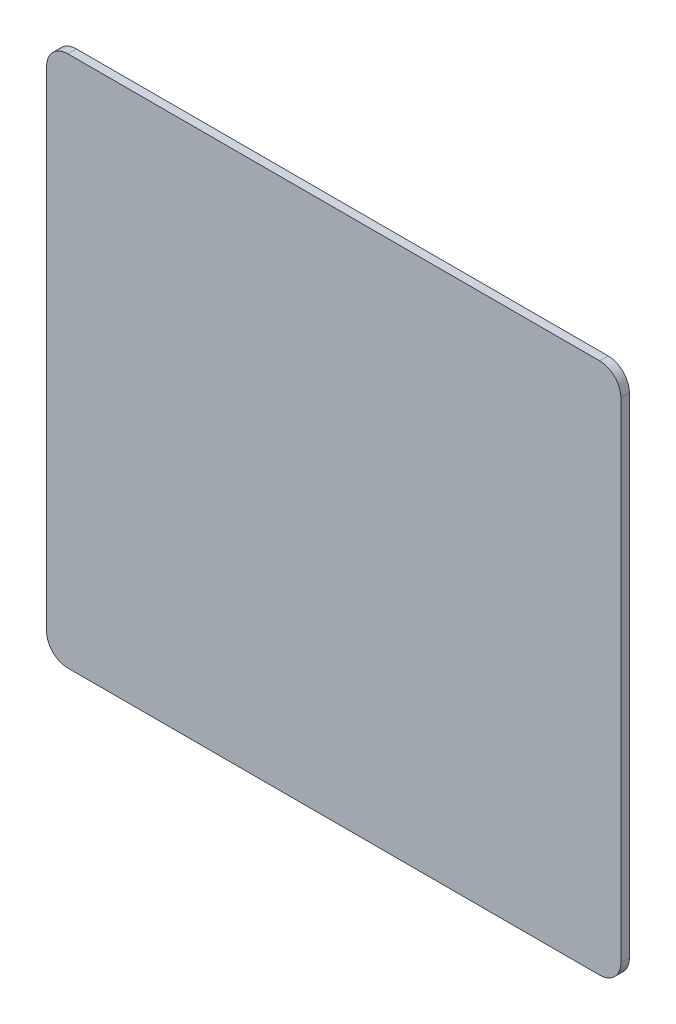
ISO-10303-21;
HEADER;
FILE_DESCRIPTION(('STEP AP214'),'2;1');
FILE_NAME('part.step','',(''),(''),'','','');
FILE_SCHEMA(('AUTOMOTIVE_DESIGN { 1 0 10303 214 1 1 1 1 }'));
ENDSEC;
DATA;
#1=APPLICATION_CONTEXT('core data for automotive mechanical design processes');
#2=APPLICATION_PROTOCOL_DEFINITION('international standard','automotive_design',2000,#1);
#3=PRODUCT_CONTEXT('',#1,'mechanical');
#4=PRODUCT('Part','Part','',(#3));
#5=PRODUCT_RELATED_PRODUCT_CATEGORY('part','',(#4));
#6=PRODUCT_DEFINITION_FORMATION('','',#4);
#7=PRODUCT_DEFINITION_CONTEXT('part definition',#1,'design');
#8=PRODUCT_DEFINITION('design','',#6,#7);
#9=PRODUCT_DEFINITION_SHAPE('','',#8);
#10=(LENGTH_UNIT() NAMED_UNIT(*) SI_UNIT(.MILLI.,.METRE.));
#11=(NAMED_UNIT(*) PLANE_ANGLE_UNIT() SI_UNIT($,.RADIAN.));
#12=(NAMED_UNIT(*) SI_UNIT($,.STERADIAN.) SOLID_ANGLE_UNIT());
#13=UNCERTAINTY_MEASURE_WITH_UNIT(LENGTH_MEASURE(1.E-05),#10,'distance_accuracy_value','');
#14=(GEOMETRIC_REPRESENTATION_CONTEXT(3) GLOBAL_UNCERTAINTY_ASSIGNED_CONTEXT((#13)) GLOBAL_UNIT_ASSIGNED_CONTEXT((#10,
#11,#12)) REPRESENTATION_CONTEXT('',''));
#15=CARTESIAN_POINT('',(0.,0.,0.));
#16=DIRECTION('',(0.,0.,1.));
#17=DIRECTION('',(1.,0.,0.));
#18=AXIS2_PLACEMENT_3D('',#15,#16,#17);
#19=CARTESIAN_POINT('',(0.,0.,3.2));
#20=DIRECTION('',(0.,0.,-1.));
#21=DIRECTION('',(-1.,0.,0.));
#22=AXIS2_PLACEMENT_3D('',#19,#20,#21);
#23=PLANE('',#22);
#24=CARTESIAN_POINT('',(99.95,-92.,3.2));
#25=DIRECTION('',(0.,0.,-1.));
#26=DIRECTION('',(-1.,0.,0.));
#27=AXIS2_PLACEMENT_3D('',#24,#25,#26);
#28=CIRCLE('',#27,8.00000000000001);
#29=CARTESIAN_POINT('',(107.95,-92.,3.2));
#30=VERTEX_POINT('',#29);
#31=CARTESIAN_POINT('',(99.95,-100.,3.2));
#32=VERTEX_POINT('',#31);
#33=EDGE_CURVE('E20',#30,#32,#28,.T.);
#34=ORIENTED_EDGE('',*,*,#33,.F.);
#35=DIRECTION('',(0.,1.,0.));
#36=VECTOR('',#35,1.);
#37=CARTESIAN_POINT('',(107.95,-100.,3.2));
#38=LINE('',#37,#36);
#39=CARTESIAN_POINT('',(107.95,92.,3.2));
#40=VERTEX_POINT('',#39);
#41=EDGE_CURVE('E96',#30,#40,#38,.T.);
#42=ORIENTED_EDGE('',*,*,#41,.T.);
#43=CARTESIAN_POINT('',(99.95,92.,3.2));
#44=DIRECTION('',(0.,0.,-1.));
#45=DIRECTION('',(-1.,0.,0.));
#46=AXIS2_PLACEMENT_3D('',#43,#44,#45);
#47=CIRCLE('',#46,8.00000000000001);
#48=CARTESIAN_POINT('',(99.95,100.,3.2));
#49=VERTEX_POINT('',#48);
#50=EDGE_CURVE('E110',#49,#40,#47,.T.);
#51=ORIENTED_EDGE('',*,*,#50,.F.);
#52=DIRECTION('',(1.,0.,0.));
#53=VECTOR('',#52,1.);
#54=CARTESIAN_POINT('',(-107.95,100.,3.2));
#55=LINE('',#54,#53);
#56=CARTESIAN_POINT('',(-99.95,100.,3.2));
#57=VERTEX_POINT('',#56);
#58=EDGE_CURVE('E107',#49,#57,#55,.F.);
#59=ORIENTED_EDGE('',*,*,#58,.T.);
#60=CARTESIAN_POINT('',(-99.95,92.,3.2));
#61=DIRECTION('',(0.,0.,-1.));
#62=DIRECTION('',(-1.,0.,0.));
#63=AXIS2_PLACEMENT_3D('',#60,#61,#62);
#64=CIRCLE('',#63,8.00000000000001);
#65=CARTESIAN_POINT('',(-107.95,92.,3.2));
#66=VERTEX_POINT('',#65);
#67=EDGE_CURVE('E114',#66,#57,#64,.T.);
#68=ORIENTED_EDGE('',*,*,#67,.F.);
#69=DIRECTION('',(0.,1.,0.));
#70=VECTOR('',#69,1.);
#71=CARTESIAN_POINT('',(-107.95,-100.,3.2));
#72=LINE('',#71,#70);
#73=CARTESIAN_POINT('',(-107.95,-92.,3.2));
#74=VERTEX_POINT('',#73);
#75=EDGE_CURVE('E113',#66,#74,#72,.F.);
#76=ORIENTED_EDGE('',*,*,#75,.T.);
#77=CARTESIAN_POINT('',(-99.95,-92.,3.2));
#78=DIRECTION('',(0.,0.,-1.));
#79=DIRECTION('',(-1.,0.,0.));
#80=AXIS2_PLACEMENT_3D('',#77,#78,#79);
#81=CIRCLE('',#80,8.00000000000001);
#82=CARTESIAN_POINT('',(-99.95,-100.,3.2));
#83=VERTEX_POINT('',#82);
#84=EDGE_CURVE('E84',#83,#74,#81,.T.);
#85=ORIENTED_EDGE('',*,*,#84,.F.);
#86=DIRECTION('',(1.,0.,0.));
#87=VECTOR('',#86,1.);
#88=CARTESIAN_POINT('',(-107.95,-100.,3.2));
#89=LINE('',#88,#87);
#90=EDGE_CURVE('E82',#83,#32,#89,.T.);
#91=ORIENTED_EDGE('',*,*,#90,.T.);
#92=EDGE_LOOP('',(#34,#42,#51,#59,#68,#76,#85,#91));
#93=FACE_BOUND('',#92,.T.);
#94=ADVANCED_FACE('F17',(#93),#23,.F.);
#95=CARTESIAN_POINT('',(107.95,-100.,3.2));
#96=DIRECTION('',(-1.,0.,0.));
#97=DIRECTION('',(0.,0.,1.));
#98=AXIS2_PLACEMENT_3D('',#95,#96,#97);
#99=PLANE('',#98);
#100=DIRECTION('',(0.,0.,-1.));
#101=VECTOR('',#100,1.);
#102=CARTESIAN_POINT('',(107.95,-92.,3.2));
#103=LINE('',#102,#101);
#104=CARTESIAN_POINT('',(107.95,-92.,0.));
#105=VERTEX_POINT('',#104);
#106=EDGE_CURVE('E89',#105,#30,#103,.F.);
#107=ORIENTED_EDGE('',*,*,#106,.F.);
#108=DIRECTION('',(0.,1.,0.));
#109=VECTOR('',#108,1.);
#110=CARTESIAN_POINT('',(107.95,0.,0.));
#111=LINE('',#110,#109);
#112=CARTESIAN_POINT('',(107.95,92.,0.));
#113=VERTEX_POINT('',#112);
#114=EDGE_CURVE('E126',#113,#105,#111,.F.);
#115=ORIENTED_EDGE('',*,*,#114,.F.);
#116=DIRECTION('',(0.,0.,-1.));
#117=VECTOR('',#116,1.);
#118=CARTESIAN_POINT('',(107.95,92.,3.2));
#119=LINE('',#118,#117);
#120=EDGE_CURVE('E129',#40,#113,#119,.T.);
#121=ORIENTED_EDGE('',*,*,#120,.F.);
#122=ORIENTED_EDGE('',*,*,#41,.F.);
#123=EDGE_LOOP('',(#107,#115,#121,#122));
#124=FACE_BOUND('',#123,.T.);
#125=ADVANCED_FACE('F163',(#124),#99,.F.);
#126=CARTESIAN_POINT('',(99.95,-92.,3.2));
#127=DIRECTION('',(0.,0.,-1.));
#128=DIRECTION('',(-1.,0.,0.));
#129=AXIS2_PLACEMENT_3D('',#126,#127,#128);
#130=CYLINDRICAL_SURFACE('',#129,8.00000000000001);
#131=CARTESIAN_POINT('',(99.95,-92.,0.));
#132=DIRECTION('',(0.,0.,-1.));
#133=DIRECTION('',(-1.,0.,0.));
#134=AXIS2_PLACEMENT_3D('',#131,#132,#133);
#135=CIRCLE('',#134,8.00000000000001);
#136=CARTESIAN_POINT('',(99.95,-100.,0.));
#137=VERTEX_POINT('',#136);
#138=EDGE_CURVE('E124',#105,#137,#135,.T.);
#139=ORIENTED_EDGE('',*,*,#138,.F.);
#140=ORIENTED_EDGE('',*,*,#106,.T.);
#141=ORIENTED_EDGE('',*,*,#33,.T.);
#142=DIRECTION('',(0.,0.,1.));
#143=VECTOR('',#142,1.);
#144=CARTESIAN_POINT('',(99.95,-100.,3.2));
#145=LINE('',#144,#143);
#146=EDGE_CURVE('E88',#32,#137,#145,.F.);
#147=ORIENTED_EDGE('',*,*,#146,.T.);
#148=EDGE_LOOP('',(#139,#140,#141,#147));
#149=FACE_BOUND('',#148,.T.);
#150=ADVANCED_FACE('F94',(#149),#130,.T.);
#151=CARTESIAN_POINT('',(-107.95,-100.,3.2));
#152=DIRECTION('',(0.,1.,0.));
#153=DIRECTION('',(0.,0.,1.));
#154=AXIS2_PLACEMENT_3D('',#151,#152,#153);
#155=PLANE('',#154);
#156=ORIENTED_EDGE('',*,*,#146,.F.);
#157=ORIENTED_EDGE('',*,*,#90,.F.);
#158=DIRECTION('',(0.,0.,-1.));
#159=VECTOR('',#158,1.);
#160=CARTESIAN_POINT('',(-99.95,-100.,3.2));
#161=LINE('',#160,#159);
#162=CARTESIAN_POINT('',(-99.95,-100.,0.));
#163=VERTEX_POINT('',#162);
#164=EDGE_CURVE('E102',#163,#83,#161,.F.);
#165=ORIENTED_EDGE('',*,*,#164,.F.);
#166=DIRECTION('',(-1.,0.,0.));
#167=VECTOR('',#166,1.);
#168=CARTESIAN_POINT('',(0.,-100.,0.));
#169=LINE('',#168,#167);
#170=EDGE_CURVE('E99',#137,#163,#169,.T.);
#171=ORIENTED_EDGE('',*,*,#170,.F.);
#172=EDGE_LOOP('',(#156,#157,#165,#171));
#173=FACE_BOUND('',#172,.T.);
#174=ADVANCED_FACE('F97',(#173),#155,.F.);
#175=CARTESIAN_POINT('',(-99.95,-92.,3.2));
#176=DIRECTION('',(0.,0.,-1.));
#177=DIRECTION('',(-1.,0.,0.));
#178=AXIS2_PLACEMENT_3D('',#175,#176,#177);
#179=CYLINDRICAL_SURFACE('',#178,8.00000000000001);
#180=CARTESIAN_POINT('',(-99.95,-92.,0.));
#181=DIRECTION('',(0.,0.,-1.));
#182=DIRECTION('',(-1.,0.,0.));
#183=AXIS2_PLACEMENT_3D('',#180,#181,#182);
#184=CIRCLE('',#183,8.00000000000001);
#185=CARTESIAN_POINT('',(-107.95,-92.,0.));
#186=VERTEX_POINT('',#185);
#187=EDGE_CURVE('E121',#163,#186,#184,.T.);
#188=ORIENTED_EDGE('',*,*,#187,.F.);
#189=ORIENTED_EDGE('',*,*,#164,.T.);
#190=ORIENTED_EDGE('',*,*,#84,.T.);
#191=DIRECTION('',(0.,0.,-1.));
#192=VECTOR('',#191,1.);
#193=CARTESIAN_POINT('',(-107.95,-92.,3.2));
#194=LINE('',#193,#192);
#195=EDGE_CURVE('E115',#74,#186,#194,.T.);
#196=ORIENTED_EDGE('',*,*,#195,.T.);
#197=EDGE_LOOP('',(#188,#189,#190,#196));
#198=FACE_BOUND('',#197,.T.);
#199=ADVANCED_FACE('F141',(#198),#179,.T.);
#200=CARTESIAN_POINT('',(-107.95,-100.,3.2));
#201=DIRECTION('',(1.,0.,0.));
#202=DIRECTION('',(0.,0.,-1.));
#203=AXIS2_PLACEMENT_3D('',#200,#201,#202);
#204=PLANE('',#203);
#205=DIRECTION('',(0.,0.,-1.));
#206=VECTOR('',#205,1.);
#207=CARTESIAN_POINT('',(-107.95,92.,3.2));
#208=LINE('',#207,#206);
#209=CARTESIAN_POINT('',(-107.95,92.,0.));
#210=VERTEX_POINT('',#209);
#211=EDGE_CURVE('E130',#210,#66,#208,.F.);
#212=ORIENTED_EDGE('',*,*,#211,.F.);
#213=DIRECTION('',(0.,1.,0.));
#214=VECTOR('',#213,1.);
#215=CARTESIAN_POINT('',(-107.95,0.,0.));
#216=LINE('',#215,#214);
#217=EDGE_CURVE('E120',#186,#210,#216,.T.);
#218=ORIENTED_EDGE('',*,*,#217,.F.);
#219=ORIENTED_EDGE('',*,*,#195,.F.);
#220=ORIENTED_EDGE('',*,*,#75,.F.);
#221=EDGE_LOOP('',(#212,#218,#219,#220));
#222=FACE_BOUND('',#221,.T.);
#223=ADVANCED_FACE('F160',(#222),#204,.F.);
#224=CARTESIAN_POINT('',(-99.95,92.,3.2));
#225=DIRECTION('',(0.,0.,-1.));
#226=DIRECTION('',(-1.,0.,0.));
#227=AXIS2_PLACEMENT_3D('',#224,#225,#226);
#228=CYLINDRICAL_SURFACE('',#227,8.00000000000001);
#229=CARTESIAN_POINT('',(-99.95,92.,0.));
#230=DIRECTION('',(0.,0.,-1.));
#231=DIRECTION('',(-1.,0.,0.));
#232=AXIS2_PLACEMENT_3D('',#229,#230,#231);
#233=CIRCLE('',#232,8.00000000000001);
#234=CARTESIAN_POINT('',(-99.95,100.,0.));
#235=VERTEX_POINT('',#234);
#236=EDGE_CURVE('E117',#210,#235,#233,.T.);
#237=ORIENTED_EDGE('',*,*,#236,.F.);
#238=ORIENTED_EDGE('',*,*,#211,.T.);
#239=ORIENTED_EDGE('',*,*,#67,.T.);
#240=DIRECTION('',(0.,0.,-1.));
#241=VECTOR('',#240,1.);
#242=CARTESIAN_POINT('',(-99.95,100.,3.2));
#243=LINE('',#242,#241);
#244=EDGE_CURVE('E111',#57,#235,#243,.T.);
#245=ORIENTED_EDGE('',*,*,#244,.T.);
#246=EDGE_LOOP('',(#237,#238,#239,#245));
#247=FACE_BOUND('',#246,.T.);
#248=ADVANCED_FACE('F158',(#247),#228,.T.);
#249=CARTESIAN_POINT('',(-107.95,100.,3.2));
#250=DIRECTION('',(0.,-1.,0.));
#251=DIRECTION('',(0.,0.,-1.));
#252=AXIS2_PLACEMENT_3D('',#249,#250,#251);
#253=PLANE('',#252);
#254=DIRECTION('',(0.,0.,-1.));
#255=VECTOR('',#254,1.);
#256=CARTESIAN_POINT('',(99.95,100.,3.2));
#257=LINE('',#256,#255);
#258=CARTESIAN_POINT('',(99.95,100.,0.));
#259=VERTEX_POINT('',#258);
#260=EDGE_CURVE('E35',#259,#49,#257,.F.);
#261=ORIENTED_EDGE('',*,*,#260,.F.);
#262=DIRECTION('',(-1.,0.,0.));
#263=VECTOR('',#262,1.);
#264=CARTESIAN_POINT('',(0.,100.,0.));
#265=LINE('',#264,#263);
#266=EDGE_CURVE('E26',#235,#259,#265,.F.);
#267=ORIENTED_EDGE('',*,*,#266,.F.);
#268=ORIENTED_EDGE('',*,*,#244,.F.);
#269=ORIENTED_EDGE('',*,*,#58,.F.);
#270=EDGE_LOOP('',(#261,#267,#268,#269));
#271=FACE_BOUND('',#270,.T.);
#272=ADVANCED_FACE('F157',(#271),#253,.F.);
#273=CARTESIAN_POINT('',(99.95,92.,3.2));
#274=DIRECTION('',(0.,0.,-1.));
#275=DIRECTION('',(-1.,0.,0.));
#276=AXIS2_PLACEMENT_3D('',#273,#274,#275);
#277=CYLINDRICAL_SURFACE('',#276,8.00000000000001);
#278=CARTESIAN_POINT('',(99.95,92.,0.));
#279=DIRECTION('',(0.,0.,-1.));
#280=DIRECTION('',(-1.,0.,0.));
#281=AXIS2_PLACEMENT_3D('',#278,#279,#280);
#282=CIRCLE('',#281,8.00000000000001);
#283=EDGE_CURVE('E11',#259,#113,#282,.T.);
#284=ORIENTED_EDGE('',*,*,#283,.F.);
#285=ORIENTED_EDGE('',*,*,#260,.T.);
#286=ORIENTED_EDGE('',*,*,#50,.T.);
#287=ORIENTED_EDGE('',*,*,#120,.T.);
#288=EDGE_LOOP('',(#284,#285,#286,#287));
#289=FACE_BOUND('',#288,.T.);
#290=ADVANCED_FACE('F154',(#289),#277,.T.);
#291=CARTESIAN_POINT('',(0.,0.,0.));
#292=DIRECTION('',(0.,0.,-1.));
#293=DIRECTION('',(-1.,0.,0.));
#294=AXIS2_PLACEMENT_3D('',#291,#292,#293);
#295=PLANE('',#294);
#296=ORIENTED_EDGE('',*,*,#266,.T.);
#297=ORIENTED_EDGE('',*,*,#283,.T.);
#298=ORIENTED_EDGE('',*,*,#114,.T.);
#299=ORIENTED_EDGE('',*,*,#138,.T.);
#300=ORIENTED_EDGE('',*,*,#170,.T.);
#301=ORIENTED_EDGE('',*,*,#187,.T.);
#302=ORIENTED_EDGE('',*,*,#217,.T.);
#303=ORIENTED_EDGE('',*,*,#236,.T.);
#304=EDGE_LOOP('',(#296,#297,#298,#299,#300,#301,#302,#303));
#305=FACE_BOUND('',#304,.T.);
#306=ADVANCED_FACE('F145',(#305),#295,.T.);
#307=CLOSED_SHELL('',(#94,#125,#150,#174,#199,#223,#248,#272,#290,#306));
#308=MANIFOLD_SOLID_BREP('B1',#307);
#309=ADVANCED_BREP_SHAPE_REPRESENTATION('',(#18,#308),#14);
#310=SHAPE_DEFINITION_REPRESENTATION(#9,#309);
ENDSEC;
END-ISO-10303-21;
